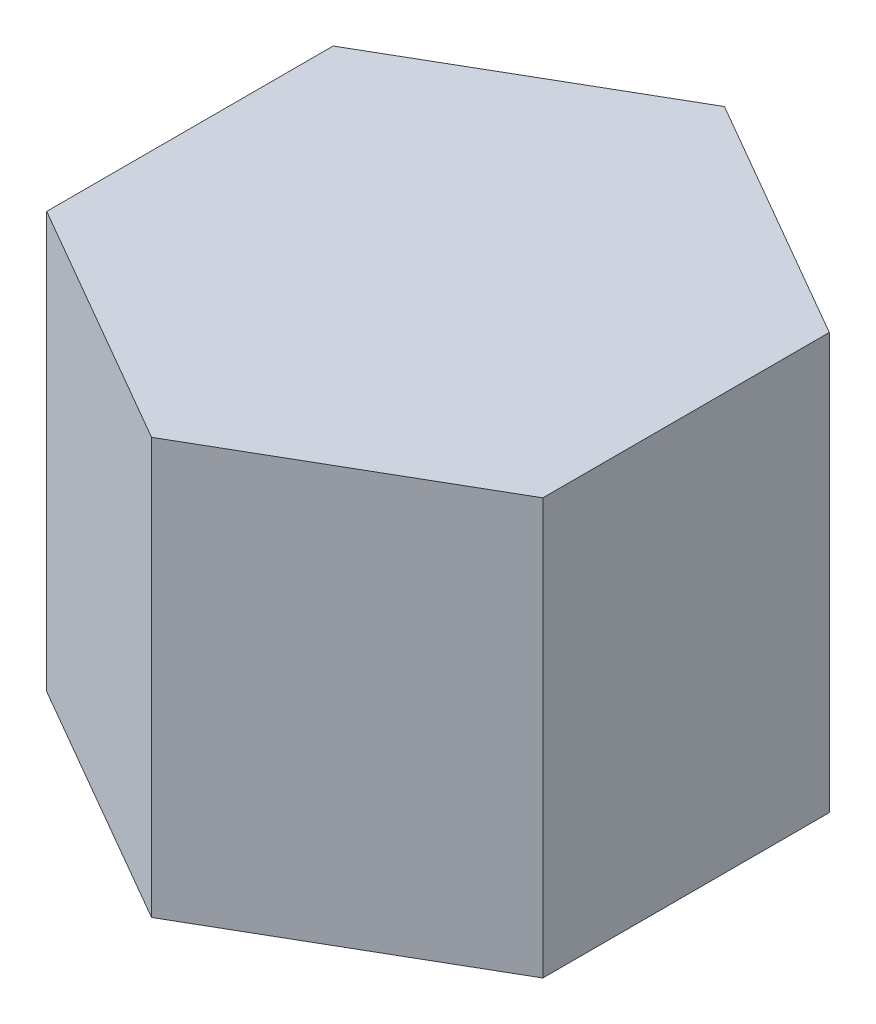
ISO-10303-21;
HEADER;
FILE_DESCRIPTION(('STEP AP214'),'2;1');
FILE_NAME('part.step','',(''),(''),'','','');
FILE_SCHEMA(('AUTOMOTIVE_DESIGN { 1 0 10303 214 1 1 1 1 }'));
ENDSEC;
DATA;
#1=APPLICATION_CONTEXT('core data for automotive mechanical design processes');
#2=APPLICATION_PROTOCOL_DEFINITION('international standard','automotive_design',2000,#1);
#3=PRODUCT_CONTEXT('',#1,'mechanical');
#4=PRODUCT('Part','Part','',(#3));
#5=PRODUCT_RELATED_PRODUCT_CATEGORY('part','',(#4));
#6=PRODUCT_DEFINITION_FORMATION('','',#4);
#7=PRODUCT_DEFINITION_CONTEXT('part definition',#1,'design');
#8=PRODUCT_DEFINITION('design','',#6,#7);
#9=PRODUCT_DEFINITION_SHAPE('','',#8);
#10=(LENGTH_UNIT() NAMED_UNIT(*) SI_UNIT(.MILLI.,.METRE.));
#11=(NAMED_UNIT(*) PLANE_ANGLE_UNIT() SI_UNIT($,.RADIAN.));
#12=(NAMED_UNIT(*) SI_UNIT($,.STERADIAN.) SOLID_ANGLE_UNIT());
#13=UNCERTAINTY_MEASURE_WITH_UNIT(LENGTH_MEASURE(1.E-05),#10,'distance_accuracy_value','');
#14=(GEOMETRIC_REPRESENTATION_CONTEXT(3) GLOBAL_UNCERTAINTY_ASSIGNED_CONTEXT((#13)) GLOBAL_UNIT_ASSIGNED_CONTEXT((#10,
#11,#12)) REPRESENTATION_CONTEXT('',''));
#15=CARTESIAN_POINT('',(0.,0.,0.));
#16=DIRECTION('',(0.,0.,1.));
#17=DIRECTION('',(1.,0.,0.));
#18=AXIS2_PLACEMENT_3D('',#15,#16,#17);
#19=CARTESIAN_POINT('',(208.642660308706,-148.537700895744,289.774920412926));
#20=DIRECTION('',(-0.499999999999943,0.,-0.866025403784472));
#21=DIRECTION('',(-0.866025403784472,0.,0.499999999999943));
#22=AXIS2_PLACEMENT_3D('',#19,#20,#21);
#23=PLANE('',#22);
#24=CARTESIAN_POINT('',(208.339551417382,-149.045793579175,289.949920412926));
#25=DIRECTION('',(0.866025403784471,0.,-0.499999999999943));
#26=VECTOR('',#25,1.);
#27=LINE('',#24,#26);
#28=CARTESIAN_POINT('',(208.339551417382,-149.045793579175,289.949920412926));
#29=VERTEX_POINT('',#28);
#30=CARTESIAN_POINT('',(208.642660308706,-149.045793579175,289.774920412926));
#31=VERTEX_POINT('',#30);
#32=EDGE_CURVE('E170',#29,#31,#27,.T.);
#33=ORIENTED_EDGE('',*,*,#32,.T.);
#34=CARTESIAN_POINT('',(208.642660308706,-148.537700895744,289.774920412926));
#35=DIRECTION('',(0.,-1.,0.));
#36=VECTOR('',#35,1.);
#37=LINE('',#34,#36);
#38=CARTESIAN_POINT('',(208.642660308706,-148.537700895744,289.774920412926));
#39=VERTEX_POINT('',#38);
#40=EDGE_CURVE('E35',#39,#31,#37,.T.);
#41=ORIENTED_EDGE('',*,*,#40,.F.);
#42=CARTESIAN_POINT('',(208.339551417382,-148.537700895744,289.949920412926));
#43=DIRECTION('',(0.866025403784471,0.,-0.499999999999943));
#44=VECTOR('',#43,1.);
#45=LINE('',#42,#44);
#46=CARTESIAN_POINT('',(208.339551417382,-148.537700895744,289.949920412926));
#47=VERTEX_POINT('',#46);
#48=EDGE_CURVE('E159',#47,#39,#45,.T.);
#49=ORIENTED_EDGE('',*,*,#48,.F.);
#50=CARTESIAN_POINT('',(208.339551417382,-148.537700895744,289.949920412926));
#51=DIRECTION('',(0.,-1.,0.));
#52=VECTOR('',#51,1.);
#53=LINE('',#50,#52);
#54=EDGE_CURVE('E10',#47,#29,#53,.T.);
#55=ORIENTED_EDGE('',*,*,#54,.T.);
#56=EDGE_LOOP('',(#33,#41,#49,#55));
#57=FACE_BOUND('',#56,.T.);
#58=ADVANCED_FACE('F16',(#57),#23,.F.);
#59=CARTESIAN_POINT('',(208.339551417382,-148.537700895744,289.949920412926));
#60=DIRECTION('',(0.500000000000096,0.,-0.866025403784383));
#61=DIRECTION('',(-0.866025403784383,0.,-0.500000000000096));
#62=AXIS2_PLACEMENT_3D('',#59,#60,#61);
#63=PLANE('',#62);
#64=CARTESIAN_POINT('',(208.036442526057,-149.045793579175,289.774920412925));
#65=DIRECTION('',(0.866025403784383,0.,0.500000000000096));
#66=VECTOR('',#65,1.);
#67=LINE('',#64,#66);
#68=CARTESIAN_POINT('',(208.036442526057,-149.045793579175,289.774920412925));
#69=VERTEX_POINT('',#68);
#70=EDGE_CURVE('E167',#69,#29,#67,.T.);
#71=ORIENTED_EDGE('',*,*,#70,.T.);
#72=ORIENTED_EDGE('',*,*,#54,.F.);
#73=CARTESIAN_POINT('',(208.036442526057,-148.537700895744,289.774920412925));
#74=DIRECTION('',(0.866025403784383,0.,0.500000000000096));
#75=VECTOR('',#74,1.);
#76=LINE('',#73,#75);
#77=CARTESIAN_POINT('',(208.036442526057,-148.537700895744,289.774920412925));
#78=VERTEX_POINT('',#77);
#79=EDGE_CURVE('E156',#78,#47,#76,.T.);
#80=ORIENTED_EDGE('',*,*,#79,.F.);
#81=CARTESIAN_POINT('',(208.036442526057,-148.537700895744,289.774920412925));
#82=DIRECTION('',(0.,-1.,0.));
#83=VECTOR('',#82,1.);
#84=LINE('',#81,#83);
#85=EDGE_CURVE('E27',#78,#69,#84,.T.);
#86=ORIENTED_EDGE('',*,*,#85,.T.);
#87=EDGE_LOOP('',(#71,#72,#80,#86));
#88=FACE_BOUND('',#87,.T.);
#89=ADVANCED_FACE('F189',(#88),#63,.F.);
#90=CARTESIAN_POINT('',(208.036442526057,-148.537700895744,290.831971220494));
#91=DIRECTION('',(1.,0.,0.));
#92=DIRECTION('',(0.,1.,0.));
#93=AXIS2_PLACEMENT_3D('',#90,#91,#92);
#94=PLANE('',#93);
#95=CARTESIAN_POINT('',(208.036442526057,-149.045793579175,289.424920412926));
#96=DIRECTION('',(0.,0.,1.));
#97=VECTOR('',#96,1.);
#98=LINE('',#95,#97);
#99=CARTESIAN_POINT('',(208.036442526057,-149.045793579175,289.424920412926));
#100=VERTEX_POINT('',#99);
#101=EDGE_CURVE('E163',#100,#69,#98,.T.);
#102=ORIENTED_EDGE('',*,*,#101,.T.);
#103=ORIENTED_EDGE('',*,*,#85,.F.);
#104=CARTESIAN_POINT('',(208.036442526057,-148.537700895744,289.424920412926));
#105=DIRECTION('',(0.,0.,1.));
#106=VECTOR('',#105,1.);
#107=LINE('',#104,#106);
#108=CARTESIAN_POINT('',(208.036442526057,-148.537700895744,289.424920412926));
#109=VERTEX_POINT('',#108);
#110=EDGE_CURVE('E106',#109,#78,#107,.T.);
#111=ORIENTED_EDGE('',*,*,#110,.F.);
#112=CARTESIAN_POINT('',(208.036442526057,-148.537700895744,289.424920412926));
#113=DIRECTION('',(0.,-1.,0.));
#114=VECTOR('',#113,1.);
#115=LINE('',#112,#114);
#116=EDGE_CURVE('E94',#109,#100,#115,.T.);
#117=ORIENTED_EDGE('',*,*,#116,.T.);
#118=EDGE_LOOP('',(#102,#103,#111,#117));
#119=FACE_BOUND('',#118,.T.);
#120=ADVANCED_FACE('F198',(#119),#94,.F.);
#121=CARTESIAN_POINT('',(208.036442526057,-148.537700895744,289.424920412926));
#122=DIRECTION('',(0.499999999999978,0.,0.866025403784452));
#123=DIRECTION('',(0.866025403784452,0.,-0.499999999999978));
#124=AXIS2_PLACEMENT_3D('',#121,#122,#123);
#125=PLANE('',#124);
#126=CARTESIAN_POINT('',(208.339551417382,-149.045793579175,289.249920412926));
#127=DIRECTION('',(-0.866025403784452,0.,0.499999999999978));
#128=VECTOR('',#127,1.);
#129=LINE('',#126,#128);
#130=CARTESIAN_POINT('',(208.339551417382,-149.045793579175,289.249920412926));
#131=VERTEX_POINT('',#130);
#132=EDGE_CURVE('E162',#131,#100,#129,.T.);
#133=ORIENTED_EDGE('',*,*,#132,.T.);
#134=ORIENTED_EDGE('',*,*,#116,.F.);
#135=CARTESIAN_POINT('',(208.339551417382,-148.537700895744,289.249920412926));
#136=DIRECTION('',(-0.866025403784452,0.,0.499999999999978));
#137=VECTOR('',#136,1.);
#138=LINE('',#135,#137);
#139=CARTESIAN_POINT('',(208.339551417382,-148.537700895744,289.249920412926));
#140=VERTEX_POINT('',#139);
#141=EDGE_CURVE('E98',#140,#109,#138,.T.);
#142=ORIENTED_EDGE('',*,*,#141,.F.);
#143=CARTESIAN_POINT('',(208.339551417382,-148.537700895744,289.249920412926));
#144=DIRECTION('',(0.,-1.,0.));
#145=VECTOR('',#144,1.);
#146=LINE('',#143,#145);
#147=EDGE_CURVE('E79',#140,#131,#146,.T.);
#148=ORIENTED_EDGE('',*,*,#147,.T.);
#149=EDGE_LOOP('',(#133,#134,#142,#148));
#150=FACE_BOUND('',#149,.T.);
#151=ADVANCED_FACE('F100',(#150),#125,.F.);
#152=CARTESIAN_POINT('',(208.339551417382,-148.537700895744,289.249920412926));
#153=DIRECTION('',(-0.499999999999943,0.,0.866025403784472));
#154=DIRECTION('',(0.866025403784472,0.,0.499999999999943));
#155=AXIS2_PLACEMENT_3D('',#152,#153,#154);
#156=PLANE('',#155);
#157=CARTESIAN_POINT('',(208.642660308706,-149.045793579175,289.424920412926));
#158=DIRECTION('',(-0.866025403784471,0.,-0.499999999999943));
#159=VECTOR('',#158,1.);
#160=LINE('',#157,#159);
#161=CARTESIAN_POINT('',(208.642660308706,-149.045793579175,289.424920412926));
#162=VERTEX_POINT('',#161);
#163=EDGE_CURVE('E88',#162,#131,#160,.T.);
#164=ORIENTED_EDGE('',*,*,#163,.T.);
#165=ORIENTED_EDGE('',*,*,#147,.F.);
#166=CARTESIAN_POINT('',(208.642660308706,-148.537700895744,289.424920412926));
#167=DIRECTION('',(-0.866025403784471,0.,-0.499999999999943));
#168=VECTOR('',#167,1.);
#169=LINE('',#166,#168);
#170=CARTESIAN_POINT('',(208.642660308706,-148.537700895744,289.424920412926));
#171=VERTEX_POINT('',#170);
#172=EDGE_CURVE('E84',#171,#140,#169,.T.);
#173=ORIENTED_EDGE('',*,*,#172,.F.);
#174=CARTESIAN_POINT('',(208.642660308706,-148.537700895744,289.424920412926));
#175=DIRECTION('',(0.,-1.,0.));
#176=VECTOR('',#175,1.);
#177=LINE('',#174,#176);
#178=EDGE_CURVE('E58',#171,#162,#177,.T.);
#179=ORIENTED_EDGE('',*,*,#178,.T.);
#180=EDGE_LOOP('',(#164,#165,#173,#179));
#181=FACE_BOUND('',#180,.T.);
#182=ADVANCED_FACE('F82',(#181),#156,.F.);
#183=CARTESIAN_POINT('',(208.642660308706,-148.537700895744,290.831971220494));
#184=DIRECTION('',(-1.,0.,0.));
#185=DIRECTION('',(0.,-1.,0.));
#186=AXIS2_PLACEMENT_3D('',#183,#184,#185);
#187=PLANE('',#186);
#188=CARTESIAN_POINT('',(208.642660308706,-149.045793579175,289.774920412926));
#189=DIRECTION('',(0.,0.,-1.));
#190=VECTOR('',#189,1.);
#191=LINE('',#188,#190);
#192=EDGE_CURVE('E160',#31,#162,#191,.T.);
#193=ORIENTED_EDGE('',*,*,#192,.T.);
#194=ORIENTED_EDGE('',*,*,#178,.F.);
#195=CARTESIAN_POINT('',(208.642660308706,-148.537700895744,289.774920412926));
#196=DIRECTION('',(0.,0.,-1.));
#197=VECTOR('',#196,1.);
#198=LINE('',#195,#197);
#199=EDGE_CURVE('E112',#39,#171,#198,.T.);
#200=ORIENTED_EDGE('',*,*,#199,.F.);
#201=ORIENTED_EDGE('',*,*,#40,.T.);
#202=EDGE_LOOP('',(#193,#194,#200,#201));
#203=FACE_BOUND('',#202,.T.);
#204=ADVANCED_FACE('F131',(#203),#187,.F.);
#205=CARTESIAN_POINT('',(206.339551417382,-148.537700895744,290.831971220494));
#206=DIRECTION('',(0.,-1.,0.));
#207=DIRECTION('',(1.,0.,0.));
#208=AXIS2_PLACEMENT_3D('',#205,#206,#207);
#209=PLANE('',#208);
#210=ORIENTED_EDGE('',*,*,#48,.T.);
#211=ORIENTED_EDGE('',*,*,#199,.T.);
#212=ORIENTED_EDGE('',*,*,#172,.T.);
#213=ORIENTED_EDGE('',*,*,#141,.T.);
#214=ORIENTED_EDGE('',*,*,#110,.T.);
#215=ORIENTED_EDGE('',*,*,#79,.T.);
#216=EDGE_LOOP('',(#210,#211,#212,#213,#214,#215));
#217=FACE_BOUND('',#216,.T.);
#218=ADVANCED_FACE('F111',(#217),#209,.F.);
#219=CARTESIAN_POINT('',(206.339551417382,-149.045793579175,290.831971220494));
#220=DIRECTION('',(0.,-1.,0.));
#221=DIRECTION('',(1.,0.,0.));
#222=AXIS2_PLACEMENT_3D('',#219,#220,#221);
#223=PLANE('',#222);
#224=ORIENTED_EDGE('',*,*,#32,.F.);
#225=ORIENTED_EDGE('',*,*,#70,.F.);
#226=ORIENTED_EDGE('',*,*,#101,.F.);
#227=ORIENTED_EDGE('',*,*,#132,.F.);
#228=ORIENTED_EDGE('',*,*,#163,.F.);
#229=ORIENTED_EDGE('',*,*,#192,.F.);
#230=EDGE_LOOP('',(#224,#225,#226,#227,#228,#229));
#231=FACE_BOUND('',#230,.T.);
#232=ADVANCED_FACE('F130',(#231),#223,.T.);
#233=CLOSED_SHELL('',(#58,#89,#120,#151,#182,#204,#218,#232));
#234=MANIFOLD_SOLID_BREP('B1',#233);
#235=ADVANCED_BREP_SHAPE_REPRESENTATION('',(#18,#234),#14);
#236=SHAPE_DEFINITION_REPRESENTATION(#9,#235);
ENDSEC;
END-ISO-10303-21;
